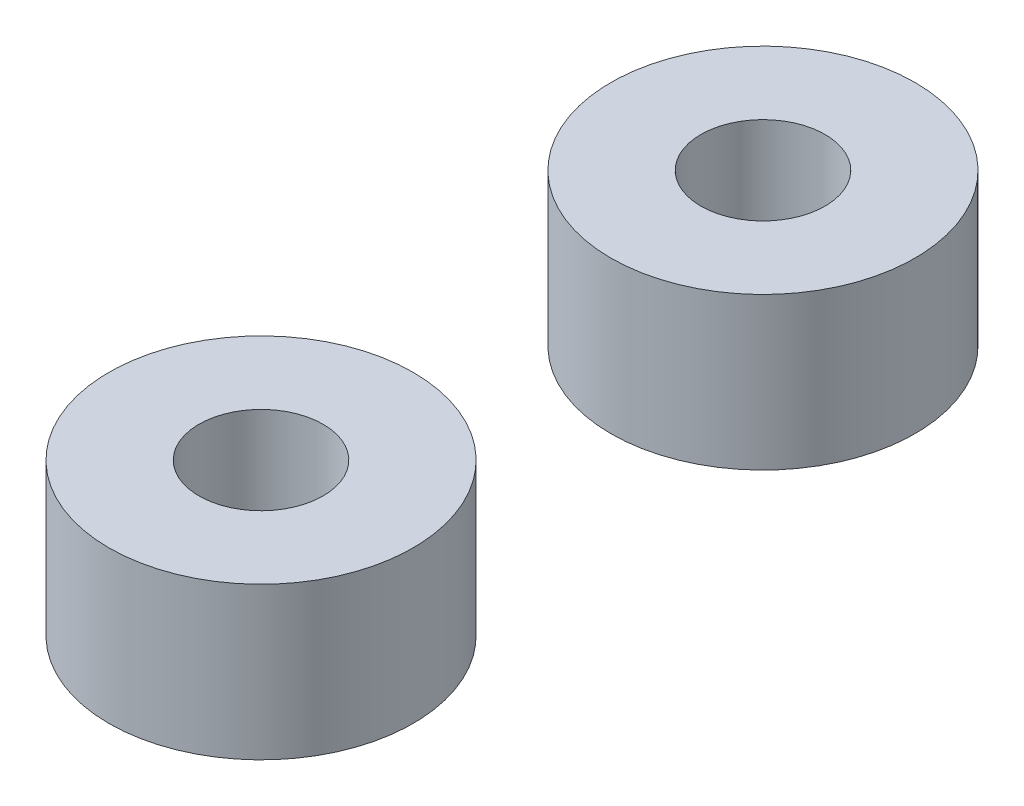
ISO-10303-21;
HEADER;
FILE_DESCRIPTION(('STEP AP214'),'2;1');
FILE_NAME('part.step','',(''),(''),'','','');
FILE_SCHEMA(('AUTOMOTIVE_DESIGN { 1 0 10303 214 1 1 1 1 }'));
ENDSEC;
DATA;
#1=APPLICATION_CONTEXT('core data for automotive mechanical design processes');
#2=APPLICATION_PROTOCOL_DEFINITION('international standard','automotive_design',2000,#1);
#3=PRODUCT_CONTEXT('',#1,'mechanical');
#4=PRODUCT('Part','Part','',(#3));
#5=PRODUCT_RELATED_PRODUCT_CATEGORY('part','',(#4));
#6=PRODUCT_DEFINITION_FORMATION('','',#4);
#7=PRODUCT_DEFINITION_CONTEXT('part definition',#1,'design');
#8=PRODUCT_DEFINITION('design','',#6,#7);
#9=PRODUCT_DEFINITION_SHAPE('','',#8);
#10=(LENGTH_UNIT() NAMED_UNIT(*) SI_UNIT(.MILLI.,.METRE.));
#11=(NAMED_UNIT(*) PLANE_ANGLE_UNIT() SI_UNIT($,.RADIAN.));
#12=(NAMED_UNIT(*) SI_UNIT($,.STERADIAN.) SOLID_ANGLE_UNIT());
#13=UNCERTAINTY_MEASURE_WITH_UNIT(LENGTH_MEASURE(1.E-05),#10,'distance_accuracy_value','');
#14=(GEOMETRIC_REPRESENTATION_CONTEXT(3) GLOBAL_UNCERTAINTY_ASSIGNED_CONTEXT((#13)) GLOBAL_UNIT_ASSIGNED_CONTEXT((#10,
#11,#12)) REPRESENTATION_CONTEXT('',''));
#15=CARTESIAN_POINT('',(0.,0.,0.));
#16=DIRECTION('',(0.,0.,1.));
#17=DIRECTION('',(1.,0.,0.));
#18=AXIS2_PLACEMENT_3D('',#15,#16,#17);
#19=CARTESIAN_POINT('',(20.,3.,4.95013043166266));
#20=DIRECTION('',(0.,-1.,0.));
#21=DIRECTION('',(0.,0.,-1.));
#22=AXIS2_PLACEMENT_3D('',#19,#20,#21);
#23=PLANE('',#22);
#24=CARTESIAN_POINT('',(20.,3.,4.95013043166266));
#25=DIRECTION('',(0.,1.,0.));
#26=DIRECTION('',(0.,0.,-1.));
#27=AXIS2_PLACEMENT_3D('',#24,#25,#26);
#28=CIRCLE('',#27,3.);
#29=CARTESIAN_POINT('',(20.,3.,1.95013043166266));
#30=VERTEX_POINT('',#29);
#31=EDGE_CURVE('E11',#30,#30,#28,.T.);
#32=ORIENTED_EDGE('',*,*,#31,.T.);
#33=EDGE_LOOP('',(#32));
#34=FACE_BOUND('',#33,.T.);
#35=CARTESIAN_POINT('',(20.,3.,4.95013043166266));
#36=DIRECTION('',(0.,1.,0.));
#37=DIRECTION('',(0.,0.,-1.));
#38=AXIS2_PLACEMENT_3D('',#35,#36,#37);
#39=CIRCLE('',#38,1.225);
#40=CARTESIAN_POINT('',(20.,3.,3.72513043166266));
#41=VERTEX_POINT('',#40);
#42=EDGE_CURVE('E52',#41,#41,#39,.T.);
#43=ORIENTED_EDGE('',*,*,#42,.F.);
#44=EDGE_LOOP('',(#43));
#45=FACE_BOUND('',#44,.T.);
#46=ADVANCED_FACE('F41',(#34,#45),#23,.F.);
#47=CARTESIAN_POINT('',(20.,0.,4.95013043166266));
#48=DIRECTION('',(0.,-1.,0.));
#49=DIRECTION('',(0.,0.,-1.));
#50=AXIS2_PLACEMENT_3D('',#47,#48,#49);
#51=PLANE('',#50);
#52=CARTESIAN_POINT('',(20.,0.,4.95013043166266));
#53=DIRECTION('',(0.,1.,0.));
#54=DIRECTION('',(0.,0.,-1.));
#55=AXIS2_PLACEMENT_3D('',#52,#53,#54);
#56=CIRCLE('',#55,3.);
#57=CARTESIAN_POINT('',(20.,0.,1.95013043166266));
#58=VERTEX_POINT('',#57);
#59=EDGE_CURVE('E45',#58,#58,#56,.T.);
#60=ORIENTED_EDGE('',*,*,#59,.F.);
#61=EDGE_LOOP('',(#60));
#62=FACE_BOUND('',#61,.T.);
#63=CARTESIAN_POINT('',(20.,0.,4.95013043166266));
#64=DIRECTION('',(0.,1.,0.));
#65=DIRECTION('',(0.,0.,-1.));
#66=AXIS2_PLACEMENT_3D('',#63,#64,#65);
#67=CIRCLE('',#66,1.225);
#68=CARTESIAN_POINT('',(20.,0.,3.72513043166266));
#69=VERTEX_POINT('',#68);
#70=EDGE_CURVE('E54',#69,#69,#67,.T.);
#71=ORIENTED_EDGE('',*,*,#70,.T.);
#72=EDGE_LOOP('',(#71));
#73=FACE_BOUND('',#72,.T.);
#74=ADVANCED_FACE('F64',(#62,#73),#51,.T.);
#75=CARTESIAN_POINT('',(20.,3.,4.95013043166266));
#76=DIRECTION('',(0.,-1.,0.));
#77=DIRECTION('',(0.,0.,-1.));
#78=AXIS2_PLACEMENT_3D('',#75,#76,#77);
#79=CYLINDRICAL_SURFACE('',#78,3.);
#80=ORIENTED_EDGE('',*,*,#31,.F.);
#81=EDGE_LOOP('',(#80));
#82=FACE_BOUND('',#81,.T.);
#83=ORIENTED_EDGE('',*,*,#59,.T.);
#84=EDGE_LOOP('',(#83));
#85=FACE_BOUND('',#84,.T.);
#86=ADVANCED_FACE('F43',(#82,#85),#79,.T.);
#87=CARTESIAN_POINT('',(20.,3.,4.95013043166266));
#88=DIRECTION('',(0.,-1.,0.));
#89=DIRECTION('',(0.,0.,-1.));
#90=AXIS2_PLACEMENT_3D('',#87,#88,#89);
#91=CYLINDRICAL_SURFACE('',#90,1.225);
#92=ORIENTED_EDGE('',*,*,#42,.T.);
#93=EDGE_LOOP('',(#92));
#94=FACE_BOUND('',#93,.T.);
#95=ORIENTED_EDGE('',*,*,#70,.F.);
#96=EDGE_LOOP('',(#95));
#97=FACE_BOUND('',#96,.T.);
#98=ADVANCED_FACE('F60',(#94,#97),#91,.F.);
#99=CLOSED_SHELL('',(#46,#74,#86,#98));
#100=MANIFOLD_SOLID_BREP('B2',#99);
#101=CARTESIAN_POINT('',(20.,3.,-4.95013043166266));
#102=DIRECTION('',(0.,1.,0.));
#103=DIRECTION('',(0.,0.,1.));
#104=AXIS2_PLACEMENT_3D('',#101,#102,#103);
#105=PLANE('',#104);
#106=CARTESIAN_POINT('',(20.,3.,-4.95013043166266));
#107=DIRECTION('',(0.,1.,0.));
#108=DIRECTION('',(0.,0.,1.));
#109=AXIS2_PLACEMENT_3D('',#106,#107,#108);
#110=CIRCLE('',#109,3.);
#111=CARTESIAN_POINT('',(20.,3.,-1.95013043166266));
#112=VERTEX_POINT('',#111);
#113=EDGE_CURVE('E40',#112,#112,#110,.T.);
#114=ORIENTED_EDGE('',*,*,#113,.T.);
#115=EDGE_LOOP('',(#114));
#116=FACE_BOUND('',#115,.T.);
#117=CARTESIAN_POINT('',(20.,3.,-4.95013043166266));
#118=DIRECTION('',(0.,1.,0.));
#119=DIRECTION('',(0.,0.,1.));
#120=AXIS2_PLACEMENT_3D('',#117,#118,#119);
#121=CIRCLE('',#120,1.225);
#122=CARTESIAN_POINT('',(20.,3.,-3.72513043166266));
#123=VERTEX_POINT('',#122);
#124=EDGE_CURVE('E114',#123,#123,#121,.T.);
#125=ORIENTED_EDGE('',*,*,#124,.F.);
#126=EDGE_LOOP('',(#125));
#127=FACE_BOUND('',#126,.T.);
#128=ADVANCED_FACE('F103',(#116,#127),#105,.T.);
#129=CARTESIAN_POINT('',(20.,0.,-4.95013043166266));
#130=DIRECTION('',(0.,1.,0.));
#131=DIRECTION('',(0.,0.,1.));
#132=AXIS2_PLACEMENT_3D('',#129,#130,#131);
#133=PLANE('',#132);
#134=CARTESIAN_POINT('',(20.,0.,-4.95013043166266));
#135=DIRECTION('',(0.,1.,0.));
#136=DIRECTION('',(0.,0.,1.));
#137=AXIS2_PLACEMENT_3D('',#134,#135,#136);
#138=CIRCLE('',#137,3.);
#139=CARTESIAN_POINT('',(20.,0.,-1.95013043166266));
#140=VERTEX_POINT('',#139);
#141=EDGE_CURVE('E107',#140,#140,#138,.T.);
#142=ORIENTED_EDGE('',*,*,#141,.F.);
#143=EDGE_LOOP('',(#142));
#144=FACE_BOUND('',#143,.T.);
#145=CARTESIAN_POINT('',(20.,0.,-4.95013043166266));
#146=DIRECTION('',(0.,1.,0.));
#147=DIRECTION('',(0.,0.,1.));
#148=AXIS2_PLACEMENT_3D('',#145,#146,#147);
#149=CIRCLE('',#148,1.225);
#150=CARTESIAN_POINT('',(20.,0.,-3.72513043166266));
#151=VERTEX_POINT('',#150);
#152=EDGE_CURVE('E116',#151,#151,#149,.T.);
#153=ORIENTED_EDGE('',*,*,#152,.T.);
#154=EDGE_LOOP('',(#153));
#155=FACE_BOUND('',#154,.T.);
#156=ADVANCED_FACE('F126',(#144,#155),#133,.F.);
#157=CARTESIAN_POINT('',(20.,3.,-4.95013043166266));
#158=DIRECTION('',(0.,-1.,0.));
#159=DIRECTION('',(0.,0.,-1.));
#160=AXIS2_PLACEMENT_3D('',#157,#158,#159);
#161=CYLINDRICAL_SURFACE('',#160,3.);
#162=ORIENTED_EDGE('',*,*,#113,.F.);
#163=EDGE_LOOP('',(#162));
#164=FACE_BOUND('',#163,.T.);
#165=ORIENTED_EDGE('',*,*,#141,.T.);
#166=EDGE_LOOP('',(#165));
#167=FACE_BOUND('',#166,.T.);
#168=ADVANCED_FACE('F105',(#164,#167),#161,.T.);
#169=CARTESIAN_POINT('',(20.,3.,-4.95013043166266));
#170=DIRECTION('',(0.,-1.,0.));
#171=DIRECTION('',(0.,0.,-1.));
#172=AXIS2_PLACEMENT_3D('',#169,#170,#171);
#173=CYLINDRICAL_SURFACE('',#172,1.225);
#174=ORIENTED_EDGE('',*,*,#124,.T.);
#175=EDGE_LOOP('',(#174));
#176=FACE_BOUND('',#175,.T.);
#177=ORIENTED_EDGE('',*,*,#152,.F.);
#178=EDGE_LOOP('',(#177));
#179=FACE_BOUND('',#178,.T.);
#180=ADVANCED_FACE('F122',(#176,#179),#173,.F.);
#181=CLOSED_SHELL('',(#128,#156,#168,#180));
#182=MANIFOLD_SOLID_BREP('B6',#181);
#183=ADVANCED_BREP_SHAPE_REPRESENTATION('',(#18,#100,#182),#14);
#184=SHAPE_DEFINITION_REPRESENTATION(#9,#183);
ENDSEC;
END-ISO-10303-21;
